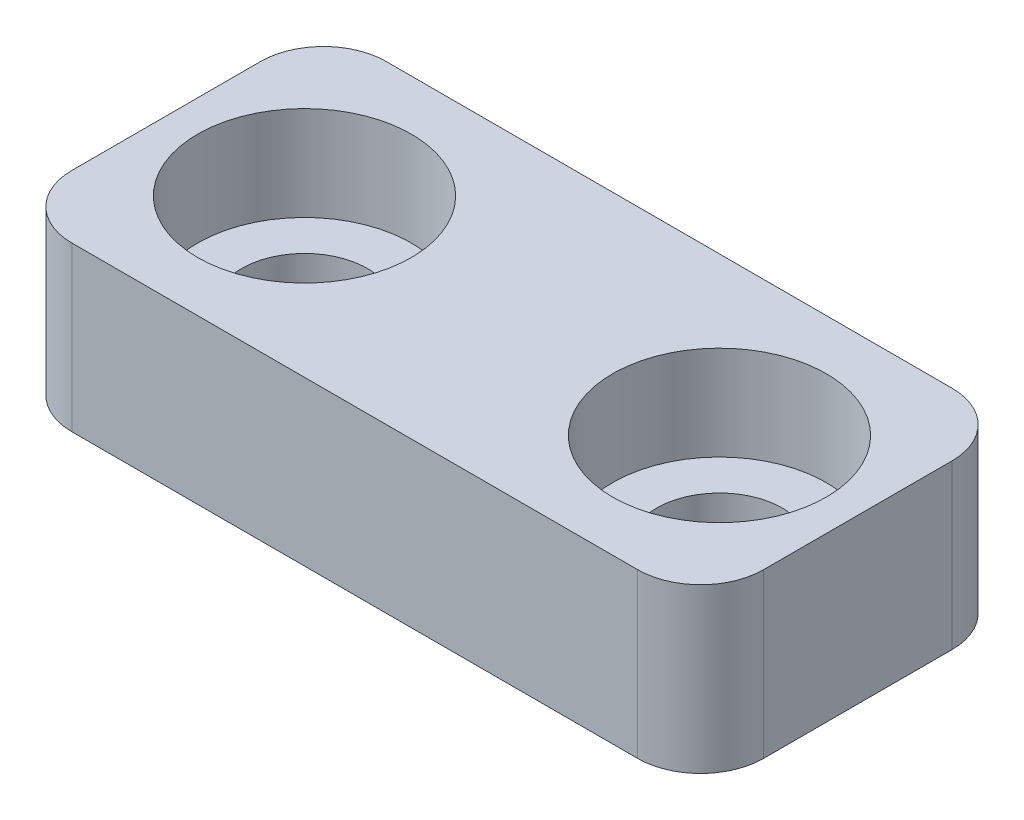
ISO-10303-21;
HEADER;
FILE_DESCRIPTION(('STEP AP214'),'2;1');
FILE_NAME('part.step','',(''),(''),'','','');
FILE_SCHEMA(('AUTOMOTIVE_DESIGN { 1 0 10303 214 1 1 1 1 }'));
ENDSEC;
DATA;
#1=APPLICATION_CONTEXT('core data for automotive mechanical design processes');
#2=APPLICATION_PROTOCOL_DEFINITION('international standard','automotive_design',2000,#1);
#3=PRODUCT_CONTEXT('',#1,'mechanical');
#4=PRODUCT('Part','Part','',(#3));
#5=PRODUCT_RELATED_PRODUCT_CATEGORY('part','',(#4));
#6=PRODUCT_DEFINITION_FORMATION('','',#4);
#7=PRODUCT_DEFINITION_CONTEXT('part definition',#1,'design');
#8=PRODUCT_DEFINITION('design','',#6,#7);
#9=PRODUCT_DEFINITION_SHAPE('','',#8);
#10=(LENGTH_UNIT() NAMED_UNIT(*) SI_UNIT(.MILLI.,.METRE.));
#11=(NAMED_UNIT(*) PLANE_ANGLE_UNIT() SI_UNIT($,.RADIAN.));
#12=(NAMED_UNIT(*) SI_UNIT($,.STERADIAN.) SOLID_ANGLE_UNIT());
#13=UNCERTAINTY_MEASURE_WITH_UNIT(LENGTH_MEASURE(1.E-05),#10,'distance_accuracy_value','');
#14=(GEOMETRIC_REPRESENTATION_CONTEXT(3) GLOBAL_UNCERTAINTY_ASSIGNED_CONTEXT((#13)) GLOBAL_UNIT_ASSIGNED_CONTEXT((#10,
#11,#12)) REPRESENTATION_CONTEXT('',''));
#15=CARTESIAN_POINT('',(0.,0.,0.));
#16=DIRECTION('',(0.,0.,1.));
#17=DIRECTION('',(1.,0.,0.));
#18=AXIS2_PLACEMENT_3D('',#15,#16,#17);
#19=CARTESIAN_POINT('',(3.30000000000001,2.6,0.));
#20=DIRECTION('',(0.,-1.,0.));
#21=DIRECTION('',(0.,0.,-1.));
#22=AXIS2_PLACEMENT_3D('',#19,#20,#21);
#23=CYLINDRICAL_SURFACE('',#22,0.999999999999999);
#24=CARTESIAN_POINT('',(3.30000000000001,0.,0.));
#25=DIRECTION('',(0.,1.,0.));
#26=DIRECTION('',(0.,0.,1.));
#27=AXIS2_PLACEMENT_3D('',#24,#25,#26);
#28=CIRCLE('',#27,0.999999999999999);
#29=CARTESIAN_POINT('',(3.30000000000001,0.,0.999999999999999));
#30=VERTEX_POINT('',#29);
#31=EDGE_CURVE('E134',#30,#30,#28,.T.);
#32=ORIENTED_EDGE('',*,*,#31,.F.);
#33=EDGE_LOOP('',(#32));
#34=FACE_BOUND('',#33,.T.);
#35=CARTESIAN_POINT('',(3.30000000000001,1.1,0.));
#36=DIRECTION('',(0.,1.,0.));
#37=DIRECTION('',(0.,0.,1.));
#38=AXIS2_PLACEMENT_3D('',#35,#36,#37);
#39=CIRCLE('',#38,0.999999999999999);
#40=CARTESIAN_POINT('',(3.30000000000001,1.1,0.999999999999999));
#41=VERTEX_POINT('',#40);
#42=EDGE_CURVE('E147',#41,#41,#39,.T.);
#43=ORIENTED_EDGE('',*,*,#42,.T.);
#44=EDGE_LOOP('',(#43));
#45=FACE_BOUND('',#44,.T.);
#46=ADVANCED_FACE('F34',(#34,#45),#23,.F.);
#47=CARTESIAN_POINT('',(-3.29999999999999,2.6,0.));
#48=DIRECTION('',(0.,-1.,0.));
#49=DIRECTION('',(0.,0.,-1.));
#50=AXIS2_PLACEMENT_3D('',#47,#48,#49);
#51=CYLINDRICAL_SURFACE('',#50,1.);
#52=CARTESIAN_POINT('',(-3.29999999999999,0.,0.));
#53=DIRECTION('',(0.,1.,0.));
#54=DIRECTION('',(0.,0.,1.));
#55=AXIS2_PLACEMENT_3D('',#52,#53,#54);
#56=CIRCLE('',#55,1.);
#57=CARTESIAN_POINT('',(-3.29999999999999,0.,1.));
#58=VERTEX_POINT('',#57);
#59=EDGE_CURVE('E128',#58,#58,#56,.T.);
#60=ORIENTED_EDGE('',*,*,#59,.F.);
#61=EDGE_LOOP('',(#60));
#62=FACE_BOUND('',#61,.T.);
#63=CARTESIAN_POINT('',(-3.29999999999999,1.1,0.));
#64=DIRECTION('',(0.,1.,0.));
#65=DIRECTION('',(0.,0.,1.));
#66=AXIS2_PLACEMENT_3D('',#63,#64,#65);
#67=CIRCLE('',#66,1.);
#68=CARTESIAN_POINT('',(-3.29999999999999,1.1,1.));
#69=VERTEX_POINT('',#68);
#70=EDGE_CURVE('E143',#69,#69,#67,.T.);
#71=ORIENTED_EDGE('',*,*,#70,.T.);
#72=EDGE_LOOP('',(#71));
#73=FACE_BOUND('',#72,.T.);
#74=ADVANCED_FACE('F214',(#62,#73),#51,.F.);
#75=CARTESIAN_POINT('',(0.,2.6,0.));
#76=DIRECTION('',(0.,-1.,0.));
#77=DIRECTION('',(0.,0.,-1.));
#78=AXIS2_PLACEMENT_3D('',#75,#76,#77);
#79=PLANE('',#78);
#80=CARTESIAN_POINT('',(3.30000000000001,2.6,0.));
#81=DIRECTION('',(0.,1.,0.));
#82=DIRECTION('',(0.,0.,1.));
#83=AXIS2_PLACEMENT_3D('',#80,#81,#82);
#84=CIRCLE('',#83,1.7);
#85=CARTESIAN_POINT('',(3.30000000000001,2.6,1.7));
#86=VERTEX_POINT('',#85);
#87=EDGE_CURVE('E196',#86,#86,#84,.T.);
#88=ORIENTED_EDGE('',*,*,#87,.F.);
#89=EDGE_LOOP('',(#88));
#90=FACE_BOUND('',#89,.T.);
#91=CARTESIAN_POINT('',(-3.29999999999999,2.6,0.));
#92=DIRECTION('',(0.,1.,0.));
#93=DIRECTION('',(0.,0.,1.));
#94=AXIS2_PLACEMENT_3D('',#91,#92,#93);
#95=CIRCLE('',#94,1.7);
#96=CARTESIAN_POINT('',(-3.29999999999999,2.6,1.7));
#97=VERTEX_POINT('',#96);
#98=EDGE_CURVE('E150',#97,#97,#95,.T.);
#99=ORIENTED_EDGE('',*,*,#98,.F.);
#100=EDGE_LOOP('',(#99));
#101=FACE_BOUND('',#100,.T.);
#102=DIRECTION('',(1.,0.,0.));
#103=VECTOR('',#102,1.);
#104=CARTESIAN_POINT('',(-5.49999999999999,2.6,2.50000000000001));
#105=LINE('',#104,#103);
#106=CARTESIAN_POINT('',(-4.49999999999999,2.6,2.50000000000001));
#107=VERTEX_POINT('',#106);
#108=CARTESIAN_POINT('',(4.50000000000001,2.6,2.50000000000001));
#109=VERTEX_POINT('',#108);
#110=EDGE_CURVE('E137',#107,#109,#105,.T.);
#111=ORIENTED_EDGE('',*,*,#110,.T.);
#112=CARTESIAN_POINT('',(4.50000000000001,2.6,1.50000000000001));
#113=DIRECTION('',(0.,-1.,0.));
#114=DIRECTION('',(0.,0.,-1.));
#115=AXIS2_PLACEMENT_3D('',#112,#113,#114);
#116=CIRCLE('',#115,1.);
#117=CARTESIAN_POINT('',(5.50000000000001,2.6,1.50000000000001));
#118=VERTEX_POINT('',#117);
#119=EDGE_CURVE('E165',#109,#118,#116,.F.);
#120=ORIENTED_EDGE('',*,*,#119,.T.);
#121=DIRECTION('',(0.,0.,-1.));
#122=VECTOR('',#121,1.);
#123=CARTESIAN_POINT('',(5.50000000000001,2.6,2.50000000000001));
#124=LINE('',#123,#122);
#125=CARTESIAN_POINT('',(5.50000000000001,2.6,-1.5));
#126=VERTEX_POINT('',#125);
#127=EDGE_CURVE('E120',#118,#126,#124,.T.);
#128=ORIENTED_EDGE('',*,*,#127,.T.);
#129=CARTESIAN_POINT('',(4.50000000000001,2.6,-1.5));
#130=DIRECTION('',(0.,-1.,0.));
#131=DIRECTION('',(0.,0.,-1.));
#132=AXIS2_PLACEMENT_3D('',#129,#130,#131);
#133=CIRCLE('',#132,1.);
#134=CARTESIAN_POINT('',(4.50000000000001,2.6,-2.5));
#135=VERTEX_POINT('',#134);
#136=EDGE_CURVE('E163',#126,#135,#133,.F.);
#137=ORIENTED_EDGE('',*,*,#136,.T.);
#138=DIRECTION('',(-1.,0.,0.));
#139=VECTOR('',#138,1.);
#140=CARTESIAN_POINT('',(-5.49999999999999,2.6,-2.5));
#141=LINE('',#140,#139);
#142=CARTESIAN_POINT('',(-4.49999999999999,2.6,-2.5));
#143=VERTEX_POINT('',#142);
#144=EDGE_CURVE('E176',#135,#143,#141,.T.);
#145=ORIENTED_EDGE('',*,*,#144,.T.);
#146=CARTESIAN_POINT('',(-4.49999999999999,2.6,-1.5));
#147=DIRECTION('',(0.,-1.,0.));
#148=DIRECTION('',(0.,0.,-1.));
#149=AXIS2_PLACEMENT_3D('',#146,#147,#148);
#150=CIRCLE('',#149,1.);
#151=CARTESIAN_POINT('',(-5.49999999999999,2.6,-1.5));
#152=VERTEX_POINT('',#151);
#153=EDGE_CURVE('E55',#143,#152,#150,.F.);
#154=ORIENTED_EDGE('',*,*,#153,.T.);
#155=DIRECTION('',(0.,0.,1.));
#156=VECTOR('',#155,1.);
#157=CARTESIAN_POINT('',(-5.49999999999999,2.6,2.50000000000001));
#158=LINE('',#157,#156);
#159=CARTESIAN_POINT('',(-5.49999999999999,2.6,1.50000000000001));
#160=VERTEX_POINT('',#159);
#161=EDGE_CURVE('E184',#152,#160,#158,.T.);
#162=ORIENTED_EDGE('',*,*,#161,.T.);
#163=CARTESIAN_POINT('',(-4.49999999999999,2.6,1.50000000000001));
#164=DIRECTION('',(0.,-1.,0.));
#165=DIRECTION('',(0.,0.,-1.));
#166=AXIS2_PLACEMENT_3D('',#163,#164,#165);
#167=CIRCLE('',#166,1.);
#168=EDGE_CURVE('E160',#160,#107,#167,.F.);
#169=ORIENTED_EDGE('',*,*,#168,.T.);
#170=EDGE_LOOP('',(#111,#120,#128,#137,#145,#154,#162,#169));
#171=FACE_BOUND('',#170,.T.);
#172=ADVANCED_FACE('F211',(#90,#101,#171),#79,.F.);
#173=CARTESIAN_POINT('',(0.,0.,0.));
#174=DIRECTION('',(0.,-1.,0.));
#175=DIRECTION('',(0.,0.,-1.));
#176=AXIS2_PLACEMENT_3D('',#173,#174,#175);
#177=PLANE('',#176);
#178=ORIENTED_EDGE('',*,*,#59,.T.);
#179=EDGE_LOOP('',(#178));
#180=FACE_BOUND('',#179,.T.);
#181=DIRECTION('',(0.,0.,-1.));
#182=VECTOR('',#181,1.);
#183=CARTESIAN_POINT('',(5.50000000000001,0.,2.50000000000001));
#184=LINE('',#183,#182);
#185=CARTESIAN_POINT('',(5.50000000000001,0.,1.50000000000001));
#186=VERTEX_POINT('',#185);
#187=CARTESIAN_POINT('',(5.50000000000001,0.,-1.5));
#188=VERTEX_POINT('',#187);
#189=EDGE_CURVE('E117',#186,#188,#184,.T.);
#190=ORIENTED_EDGE('',*,*,#189,.F.);
#191=CARTESIAN_POINT('',(4.50000000000001,0.,1.50000000000001));
#192=DIRECTION('',(0.,-1.,0.));
#193=DIRECTION('',(0.,0.,-1.));
#194=AXIS2_PLACEMENT_3D('',#191,#192,#193);
#195=CIRCLE('',#194,1.);
#196=CARTESIAN_POINT('',(4.50000000000001,0.,2.50000000000001));
#197=VERTEX_POINT('',#196);
#198=EDGE_CURVE('E100',#186,#197,#195,.T.);
#199=ORIENTED_EDGE('',*,*,#198,.T.);
#200=DIRECTION('',(1.,0.,0.));
#201=VECTOR('',#200,1.);
#202=CARTESIAN_POINT('',(-5.49999999999999,0.,2.50000000000001));
#203=LINE('',#202,#201);
#204=CARTESIAN_POINT('',(-4.49999999999999,0.,2.50000000000001));
#205=VERTEX_POINT('',#204);
#206=EDGE_CURVE('E141',#205,#197,#203,.T.);
#207=ORIENTED_EDGE('',*,*,#206,.F.);
#208=CARTESIAN_POINT('',(-4.49999999999999,0.,1.50000000000001));
#209=DIRECTION('',(0.,-1.,0.));
#210=DIRECTION('',(0.,0.,-1.));
#211=AXIS2_PLACEMENT_3D('',#208,#209,#210);
#212=CIRCLE('',#211,1.);
#213=CARTESIAN_POINT('',(-5.49999999999999,0.,1.50000000000001));
#214=VERTEX_POINT('',#213);
#215=EDGE_CURVE('E121',#205,#214,#212,.T.);
#216=ORIENTED_EDGE('',*,*,#215,.T.);
#217=DIRECTION('',(0.,0.,1.));
#218=VECTOR('',#217,1.);
#219=CARTESIAN_POINT('',(-5.49999999999999,0.,2.50000000000001));
#220=LINE('',#219,#218);
#221=CARTESIAN_POINT('',(-5.49999999999999,0.,-1.5));
#222=VERTEX_POINT('',#221);
#223=EDGE_CURVE('E131',#222,#214,#220,.T.);
#224=ORIENTED_EDGE('',*,*,#223,.F.);
#225=CARTESIAN_POINT('',(-4.49999999999999,0.,-1.5));
#226=DIRECTION('',(0.,-1.,0.));
#227=DIRECTION('',(0.,0.,-1.));
#228=AXIS2_PLACEMENT_3D('',#225,#226,#227);
#229=CIRCLE('',#228,1.);
#230=CARTESIAN_POINT('',(-4.49999999999999,0.,-2.5));
#231=VERTEX_POINT('',#230);
#232=EDGE_CURVE('E154',#222,#231,#229,.T.);
#233=ORIENTED_EDGE('',*,*,#232,.T.);
#234=DIRECTION('',(-1.,0.,0.));
#235=VECTOR('',#234,1.);
#236=CARTESIAN_POINT('',(-5.49999999999999,0.,-2.5));
#237=LINE('',#236,#235);
#238=CARTESIAN_POINT('',(4.50000000000001,0.,-2.5));
#239=VERTEX_POINT('',#238);
#240=EDGE_CURVE('E127',#239,#231,#237,.T.);
#241=ORIENTED_EDGE('',*,*,#240,.F.);
#242=CARTESIAN_POINT('',(4.50000000000001,0.,-1.5));
#243=DIRECTION('',(0.,-1.,0.));
#244=DIRECTION('',(0.,0.,-1.));
#245=AXIS2_PLACEMENT_3D('',#242,#243,#244);
#246=CIRCLE('',#245,1.);
#247=EDGE_CURVE('E111',#239,#188,#246,.T.);
#248=ORIENTED_EDGE('',*,*,#247,.T.);
#249=EDGE_LOOP('',(#190,#199,#207,#216,#224,#233,#241,#248));
#250=FACE_BOUND('',#249,.T.);
#251=ORIENTED_EDGE('',*,*,#31,.T.);
#252=EDGE_LOOP('',(#251));
#253=FACE_BOUND('',#252,.T.);
#254=ADVANCED_FACE('F124',(#180,#250,#253),#177,.T.);
#255=CARTESIAN_POINT('',(5.50000000000001,2.6,2.50000000000001));
#256=DIRECTION('',(-1.,0.,0.));
#257=DIRECTION('',(0.,0.,1.));
#258=AXIS2_PLACEMENT_3D('',#255,#256,#257);
#259=PLANE('',#258);
#260=ORIENTED_EDGE('',*,*,#127,.F.);
#261=DIRECTION('',(0.,-1.,0.));
#262=VECTOR('',#261,1.);
#263=CARTESIAN_POINT('',(5.50000000000001,2.6,1.50000000000001));
#264=LINE('',#263,#262);
#265=EDGE_CURVE('E104',#118,#186,#264,.T.);
#266=ORIENTED_EDGE('',*,*,#265,.T.);
#267=ORIENTED_EDGE('',*,*,#189,.T.);
#268=DIRECTION('',(0.,-1.,0.));
#269=VECTOR('',#268,1.);
#270=CARTESIAN_POINT('',(5.50000000000001,2.6,-1.5));
#271=LINE('',#270,#269);
#272=EDGE_CURVE('E122',#188,#126,#271,.F.);
#273=ORIENTED_EDGE('',*,*,#272,.T.);
#274=EDGE_LOOP('',(#260,#266,#267,#273));
#275=FACE_BOUND('',#274,.T.);
#276=ADVANCED_FACE('F116',(#275),#259,.F.);
#277=CARTESIAN_POINT('',(-5.49999999999999,2.6,-2.5));
#278=DIRECTION('',(0.,0.,1.));
#279=DIRECTION('',(1.,0.,0.));
#280=AXIS2_PLACEMENT_3D('',#277,#278,#279);
#281=PLANE('',#280);
#282=ORIENTED_EDGE('',*,*,#144,.F.);
#283=DIRECTION('',(0.,-1.,0.));
#284=VECTOR('',#283,1.);
#285=CARTESIAN_POINT('',(4.50000000000001,2.6,-2.5));
#286=LINE('',#285,#284);
#287=EDGE_CURVE('E169',#135,#239,#286,.T.);
#288=ORIENTED_EDGE('',*,*,#287,.T.);
#289=ORIENTED_EDGE('',*,*,#240,.T.);
#290=DIRECTION('',(0.,-1.,0.));
#291=VECTOR('',#290,1.);
#292=CARTESIAN_POINT('',(-4.49999999999999,2.6,-2.5));
#293=LINE('',#292,#291);
#294=EDGE_CURVE('E167',#231,#143,#293,.F.);
#295=ORIENTED_EDGE('',*,*,#294,.T.);
#296=EDGE_LOOP('',(#282,#288,#289,#295));
#297=FACE_BOUND('',#296,.T.);
#298=ADVANCED_FACE('F174',(#297),#281,.F.);
#299=CARTESIAN_POINT('',(-5.49999999999999,2.6,2.50000000000001));
#300=DIRECTION('',(1.,0.,0.));
#301=DIRECTION('',(0.,0.,-1.));
#302=AXIS2_PLACEMENT_3D('',#299,#300,#301);
#303=PLANE('',#302);
#304=ORIENTED_EDGE('',*,*,#161,.F.);
#305=DIRECTION('',(0.,-1.,0.));
#306=VECTOR('',#305,1.);
#307=CARTESIAN_POINT('',(-5.49999999999999,2.6,-1.5));
#308=LINE('',#307,#306);
#309=EDGE_CURVE('E11',#152,#222,#308,.T.);
#310=ORIENTED_EDGE('',*,*,#309,.T.);
#311=ORIENTED_EDGE('',*,*,#223,.T.);
#312=DIRECTION('',(0.,-1.,0.));
#313=VECTOR('',#312,1.);
#314=CARTESIAN_POINT('',(-5.49999999999999,2.6,1.50000000000001));
#315=LINE('',#314,#313);
#316=EDGE_CURVE('E42',#214,#160,#315,.F.);
#317=ORIENTED_EDGE('',*,*,#316,.T.);
#318=EDGE_LOOP('',(#304,#310,#311,#317));
#319=FACE_BOUND('',#318,.T.);
#320=ADVANCED_FACE('F183',(#319),#303,.F.);
#321=CARTESIAN_POINT('',(-5.49999999999999,2.6,2.50000000000001));
#322=DIRECTION('',(0.,0.,-1.));
#323=DIRECTION('',(-1.,0.,0.));
#324=AXIS2_PLACEMENT_3D('',#321,#322,#323);
#325=PLANE('',#324);
#326=ORIENTED_EDGE('',*,*,#206,.T.);
#327=DIRECTION('',(0.,-1.,0.));
#328=VECTOR('',#327,1.);
#329=CARTESIAN_POINT('',(4.50000000000001,2.6,2.50000000000001));
#330=LINE('',#329,#328);
#331=EDGE_CURVE('E105',#197,#109,#330,.F.);
#332=ORIENTED_EDGE('',*,*,#331,.T.);
#333=ORIENTED_EDGE('',*,*,#110,.F.);
#334=DIRECTION('',(0.,-1.,0.));
#335=VECTOR('',#334,1.);
#336=CARTESIAN_POINT('',(-4.49999999999999,2.6,2.50000000000001));
#337=LINE('',#336,#335);
#338=EDGE_CURVE('E110',#107,#205,#337,.T.);
#339=ORIENTED_EDGE('',*,*,#338,.T.);
#340=EDGE_LOOP('',(#326,#332,#333,#339));
#341=FACE_BOUND('',#340,.T.);
#342=ADVANCED_FACE('F220',(#341),#325,.F.);
#343=CARTESIAN_POINT('',(-3.29999999999999,1.1,0.));
#344=DIRECTION('',(0.,1.,0.));
#345=DIRECTION('',(0.,0.,1.));
#346=AXIS2_PLACEMENT_3D('',#343,#344,#345);
#347=CYLINDRICAL_SURFACE('',#346,1.7);
#348=CARTESIAN_POINT('',(-3.29999999999999,1.1,0.));
#349=DIRECTION('',(0.,1.,0.));
#350=DIRECTION('',(0.,0.,1.));
#351=AXIS2_PLACEMENT_3D('',#348,#349,#350);
#352=CIRCLE('',#351,1.7);
#353=CARTESIAN_POINT('',(-3.29999999999999,1.1,1.7));
#354=VERTEX_POINT('',#353);
#355=EDGE_CURVE('E146',#354,#354,#352,.T.);
#356=ORIENTED_EDGE('',*,*,#355,.F.);
#357=EDGE_LOOP('',(#356));
#358=FACE_BOUND('',#357,.T.);
#359=ORIENTED_EDGE('',*,*,#98,.T.);
#360=EDGE_LOOP('',(#359));
#361=FACE_BOUND('',#360,.T.);
#362=ADVANCED_FACE('F238',(#358,#361),#347,.F.);
#363=CARTESIAN_POINT('',(-3.29999999999999,1.1,0.));
#364=DIRECTION('',(0.,1.,0.));
#365=DIRECTION('',(0.,0.,1.));
#366=AXIS2_PLACEMENT_3D('',#363,#364,#365);
#367=PLANE('',#366);
#368=ORIENTED_EDGE('',*,*,#70,.F.);
#369=EDGE_LOOP('',(#368));
#370=FACE_BOUND('',#369,.T.);
#371=ORIENTED_EDGE('',*,*,#355,.T.);
#372=EDGE_LOOP('',(#371));
#373=FACE_BOUND('',#372,.T.);
#374=ADVANCED_FACE('F207',(#370,#373),#367,.T.);
#375=CARTESIAN_POINT('',(3.30000000000001,1.1,0.));
#376=DIRECTION('',(0.,1.,0.));
#377=DIRECTION('',(0.,0.,1.));
#378=AXIS2_PLACEMENT_3D('',#375,#376,#377);
#379=CYLINDRICAL_SURFACE('',#378,1.7);
#380=CARTESIAN_POINT('',(3.30000000000001,1.1,0.));
#381=DIRECTION('',(0.,1.,0.));
#382=DIRECTION('',(0.,0.,1.));
#383=AXIS2_PLACEMENT_3D('',#380,#381,#382);
#384=CIRCLE('',#383,1.7);
#385=CARTESIAN_POINT('',(3.30000000000001,1.1,1.7));
#386=VERTEX_POINT('',#385);
#387=EDGE_CURVE('E151',#386,#386,#384,.T.);
#388=ORIENTED_EDGE('',*,*,#387,.F.);
#389=EDGE_LOOP('',(#388));
#390=FACE_BOUND('',#389,.T.);
#391=ORIENTED_EDGE('',*,*,#87,.T.);
#392=EDGE_LOOP('',(#391));
#393=FACE_BOUND('',#392,.T.);
#394=ADVANCED_FACE('F204',(#390,#393),#379,.F.);
#395=CARTESIAN_POINT('',(3.30000000000001,1.1,0.));
#396=DIRECTION('',(0.,1.,0.));
#397=DIRECTION('',(0.,0.,1.));
#398=AXIS2_PLACEMENT_3D('',#395,#396,#397);
#399=PLANE('',#398);
#400=ORIENTED_EDGE('',*,*,#42,.F.);
#401=EDGE_LOOP('',(#400));
#402=FACE_BOUND('',#401,.T.);
#403=ORIENTED_EDGE('',*,*,#387,.T.);
#404=EDGE_LOOP('',(#403));
#405=FACE_BOUND('',#404,.T.);
#406=ADVANCED_FACE('F202',(#402,#405),#399,.T.);
#407=CARTESIAN_POINT('',(4.50000000000001,2.6,1.50000000000001));
#408=DIRECTION('',(0.,-1.,0.));
#409=DIRECTION('',(0.,0.,-1.));
#410=AXIS2_PLACEMENT_3D('',#407,#408,#409);
#411=CYLINDRICAL_SURFACE('',#410,1.);
#412=ORIENTED_EDGE('',*,*,#119,.F.);
#413=ORIENTED_EDGE('',*,*,#331,.F.);
#414=ORIENTED_EDGE('',*,*,#198,.F.);
#415=ORIENTED_EDGE('',*,*,#265,.F.);
#416=EDGE_LOOP('',(#412,#413,#414,#415));
#417=FACE_BOUND('',#416,.T.);
#418=ADVANCED_FACE('F103',(#417),#411,.T.);
#419=CARTESIAN_POINT('',(4.50000000000001,2.6,-1.5));
#420=DIRECTION('',(0.,-1.,0.));
#421=DIRECTION('',(0.,0.,-1.));
#422=AXIS2_PLACEMENT_3D('',#419,#420,#421);
#423=CYLINDRICAL_SURFACE('',#422,1.);
#424=ORIENTED_EDGE('',*,*,#136,.F.);
#425=ORIENTED_EDGE('',*,*,#272,.F.);
#426=ORIENTED_EDGE('',*,*,#247,.F.);
#427=ORIENTED_EDGE('',*,*,#287,.F.);
#428=EDGE_LOOP('',(#424,#425,#426,#427));
#429=FACE_BOUND('',#428,.T.);
#430=ADVANCED_FACE('F226',(#429),#423,.T.);
#431=CARTESIAN_POINT('',(-4.49999999999999,2.6,-1.5));
#432=DIRECTION('',(0.,-1.,0.));
#433=DIRECTION('',(0.,0.,-1.));
#434=AXIS2_PLACEMENT_3D('',#431,#432,#433);
#435=CYLINDRICAL_SURFACE('',#434,1.);
#436=ORIENTED_EDGE('',*,*,#153,.F.);
#437=ORIENTED_EDGE('',*,*,#294,.F.);
#438=ORIENTED_EDGE('',*,*,#232,.F.);
#439=ORIENTED_EDGE('',*,*,#309,.F.);
#440=EDGE_LOOP('',(#436,#437,#438,#439));
#441=FACE_BOUND('',#440,.T.);
#442=ADVANCED_FACE('F182',(#441),#435,.T.);
#443=CARTESIAN_POINT('',(-4.49999999999999,2.6,1.50000000000001));
#444=DIRECTION('',(0.,-1.,0.));
#445=DIRECTION('',(0.,0.,-1.));
#446=AXIS2_PLACEMENT_3D('',#443,#444,#445);
#447=CYLINDRICAL_SURFACE('',#446,1.);
#448=ORIENTED_EDGE('',*,*,#168,.F.);
#449=ORIENTED_EDGE('',*,*,#316,.F.);
#450=ORIENTED_EDGE('',*,*,#215,.F.);
#451=ORIENTED_EDGE('',*,*,#338,.F.);
#452=EDGE_LOOP('',(#448,#449,#450,#451));
#453=FACE_BOUND('',#452,.T.);
#454=ADVANCED_FACE('F36',(#453),#447,.T.);
#455=CLOSED_SHELL('',(#46,#74,#172,#254,#276,#298,#320,#342,#362,#374,#394,#406,#418,#430,#442,#454));
#456=MANIFOLD_SOLID_BREP('B2',#455);
#457=ADVANCED_BREP_SHAPE_REPRESENTATION('',(#18,#456),#14);
#458=SHAPE_DEFINITION_REPRESENTATION(#9,#457);
ENDSEC;
END-ISO-10303-21;
